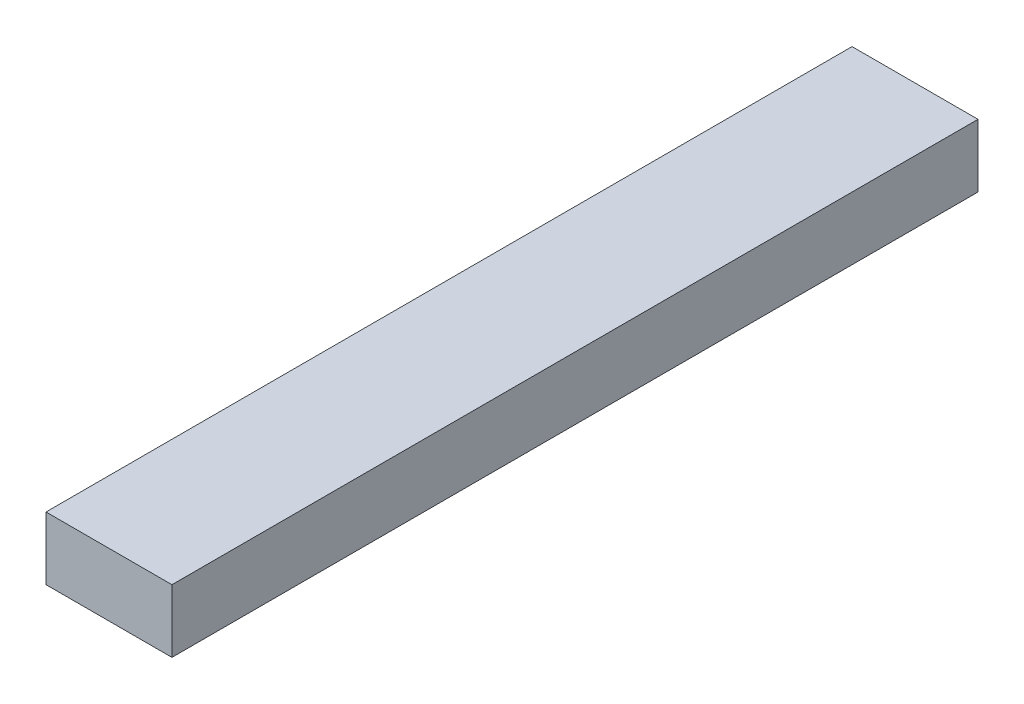
ISO-10303-21;
HEADER;
FILE_DESCRIPTION(('STEP AP214'),'2;1');
FILE_NAME('part.step','',(''),(''),'','','');
FILE_SCHEMA(('AUTOMOTIVE_DESIGN { 1 0 10303 214 1 1 1 1 }'));
ENDSEC;
DATA;
#1=APPLICATION_CONTEXT('core data for automotive mechanical design processes');
#2=APPLICATION_PROTOCOL_DEFINITION('international standard','automotive_design',2000,#1);
#3=PRODUCT_CONTEXT('',#1,'mechanical');
#4=PRODUCT('Part','Part','',(#3));
#5=PRODUCT_RELATED_PRODUCT_CATEGORY('part','',(#4));
#6=PRODUCT_DEFINITION_FORMATION('','',#4);
#7=PRODUCT_DEFINITION_CONTEXT('part definition',#1,'design');
#8=PRODUCT_DEFINITION('design','',#6,#7);
#9=PRODUCT_DEFINITION_SHAPE('','',#8);
#10=(LENGTH_UNIT() NAMED_UNIT(*) SI_UNIT(.MILLI.,.METRE.));
#11=(NAMED_UNIT(*) PLANE_ANGLE_UNIT() SI_UNIT($,.RADIAN.));
#12=(NAMED_UNIT(*) SI_UNIT($,.STERADIAN.) SOLID_ANGLE_UNIT());
#13=UNCERTAINTY_MEASURE_WITH_UNIT(LENGTH_MEASURE(1.E-05),#10,'distance_accuracy_value','');
#14=(GEOMETRIC_REPRESENTATION_CONTEXT(3) GLOBAL_UNCERTAINTY_ASSIGNED_CONTEXT((#13)) GLOBAL_UNIT_ASSIGNED_CONTEXT((#10,
#11,#12)) REPRESENTATION_CONTEXT('',''));
#15=CARTESIAN_POINT('',(0.,0.,0.));
#16=DIRECTION('',(0.,0.,1.));
#17=DIRECTION('',(1.,0.,0.));
#18=AXIS2_PLACEMENT_3D('',#15,#16,#17);
#19=CARTESIAN_POINT('',(50.,-25.,640.));
#20=DIRECTION('',(-1.,0.,0.));
#21=DIRECTION('',(0.,0.,1.));
#22=AXIS2_PLACEMENT_3D('',#19,#20,#21);
#23=PLANE('',#22);
#24=DIRECTION('',(0.,1.,0.));
#25=VECTOR('',#24,1.);
#26=CARTESIAN_POINT('',(50.,-25.,0.));
#27=LINE('',#26,#25);
#28=CARTESIAN_POINT('',(50.,-25.,0.));
#29=VERTEX_POINT('',#28);
#30=CARTESIAN_POINT('',(50.,25.,0.));
#31=VERTEX_POINT('',#30);
#32=EDGE_CURVE('E107',#29,#31,#27,.T.);
#33=ORIENTED_EDGE('',*,*,#32,.T.);
#34=DIRECTION('',(0.,0.,-1.));
#35=VECTOR('',#34,1.);
#36=CARTESIAN_POINT('',(50.,25.,640.));
#37=LINE('',#36,#35);
#38=CARTESIAN_POINT('',(50.,25.,640.));
#39=VERTEX_POINT('',#38);
#40=EDGE_CURVE('E11',#39,#31,#37,.T.);
#41=ORIENTED_EDGE('',*,*,#40,.F.);
#42=DIRECTION('',(0.,1.,0.));
#43=VECTOR('',#42,1.);
#44=CARTESIAN_POINT('',(50.,-25.,640.));
#45=LINE('',#44,#43);
#46=CARTESIAN_POINT('',(50.,-25.,640.));
#47=VERTEX_POINT('',#46);
#48=EDGE_CURVE('E91',#47,#39,#45,.T.);
#49=ORIENTED_EDGE('',*,*,#48,.F.);
#50=DIRECTION('',(0.,0.,-1.));
#51=VECTOR('',#50,1.);
#52=CARTESIAN_POINT('',(50.,-25.,640.));
#53=LINE('',#52,#51);
#54=EDGE_CURVE('E103',#47,#29,#53,.T.);
#55=ORIENTED_EDGE('',*,*,#54,.T.);
#56=EDGE_LOOP('',(#33,#41,#49,#55));
#57=FACE_BOUND('',#56,.T.);
#58=ADVANCED_FACE('F39',(#57),#23,.F.);
#59=CARTESIAN_POINT('',(-50.,25.,640.));
#60=DIRECTION('',(0.,-1.,0.));
#61=DIRECTION('',(0.,0.,-1.));
#62=AXIS2_PLACEMENT_3D('',#59,#60,#61);
#63=PLANE('',#62);
#64=DIRECTION('',(-1.,0.,0.));
#65=VECTOR('',#64,1.);
#66=CARTESIAN_POINT('',(-50.,25.,0.));
#67=LINE('',#66,#65);
#68=CARTESIAN_POINT('',(-50.,25.,0.));
#69=VERTEX_POINT('',#68);
#70=EDGE_CURVE('E96',#31,#69,#67,.T.);
#71=ORIENTED_EDGE('',*,*,#70,.T.);
#72=DIRECTION('',(0.,0.,-1.));
#73=VECTOR('',#72,1.);
#74=CARTESIAN_POINT('',(-50.,25.,640.));
#75=LINE('',#74,#73);
#76=CARTESIAN_POINT('',(-50.,25.,640.));
#77=VERTEX_POINT('',#76);
#78=EDGE_CURVE('E48',#77,#69,#75,.T.);
#79=ORIENTED_EDGE('',*,*,#78,.F.);
#80=DIRECTION('',(-1.,0.,0.));
#81=VECTOR('',#80,1.);
#82=CARTESIAN_POINT('',(-50.,25.,640.));
#83=LINE('',#82,#81);
#84=EDGE_CURVE('E86',#39,#77,#83,.T.);
#85=ORIENTED_EDGE('',*,*,#84,.F.);
#86=ORIENTED_EDGE('',*,*,#40,.T.);
#87=EDGE_LOOP('',(#71,#79,#85,#86));
#88=FACE_BOUND('',#87,.T.);
#89=ADVANCED_FACE('F95',(#88),#63,.F.);
#90=CARTESIAN_POINT('',(-50.,-25.,640.));
#91=DIRECTION('',(1.,0.,0.));
#92=DIRECTION('',(0.,0.,-1.));
#93=AXIS2_PLACEMENT_3D('',#90,#91,#92);
#94=PLANE('',#93);
#95=DIRECTION('',(0.,-1.,0.));
#96=VECTOR('',#95,1.);
#97=CARTESIAN_POINT('',(-50.,-25.,0.));
#98=LINE('',#97,#96);
#99=CARTESIAN_POINT('',(-50.,-25.,0.));
#100=VERTEX_POINT('',#99);
#101=EDGE_CURVE('E73',#69,#100,#98,.T.);
#102=ORIENTED_EDGE('',*,*,#101,.T.);
#103=DIRECTION('',(0.,0.,-1.));
#104=VECTOR('',#103,1.);
#105=CARTESIAN_POINT('',(-50.,-25.,640.));
#106=LINE('',#105,#104);
#107=CARTESIAN_POINT('',(-50.,-25.,640.));
#108=VERTEX_POINT('',#107);
#109=EDGE_CURVE('E98',#108,#100,#106,.T.);
#110=ORIENTED_EDGE('',*,*,#109,.F.);
#111=DIRECTION('',(0.,-1.,0.));
#112=VECTOR('',#111,1.);
#113=CARTESIAN_POINT('',(-50.,-25.,640.));
#114=LINE('',#113,#112);
#115=EDGE_CURVE('E89',#77,#108,#114,.T.);
#116=ORIENTED_EDGE('',*,*,#115,.F.);
#117=ORIENTED_EDGE('',*,*,#78,.T.);
#118=EDGE_LOOP('',(#102,#110,#116,#117));
#119=FACE_BOUND('',#118,.T.);
#120=ADVANCED_FACE('F99',(#119),#94,.F.);
#121=CARTESIAN_POINT('',(-50.,-25.,640.));
#122=DIRECTION('',(0.,1.,0.));
#123=DIRECTION('',(0.,0.,1.));
#124=AXIS2_PLACEMENT_3D('',#121,#122,#123);
#125=PLANE('',#124);
#126=DIRECTION('',(1.,0.,0.));
#127=VECTOR('',#126,1.);
#128=CARTESIAN_POINT('',(-50.,-25.,0.));
#129=LINE('',#128,#127);
#130=EDGE_CURVE('E79',#100,#29,#129,.T.);
#131=ORIENTED_EDGE('',*,*,#130,.T.);
#132=ORIENTED_EDGE('',*,*,#54,.F.);
#133=DIRECTION('',(1.,0.,0.));
#134=VECTOR('',#133,1.);
#135=CARTESIAN_POINT('',(-50.,-25.,640.));
#136=LINE('',#135,#134);
#137=EDGE_CURVE('E56',#108,#47,#136,.T.);
#138=ORIENTED_EDGE('',*,*,#137,.F.);
#139=ORIENTED_EDGE('',*,*,#109,.T.);
#140=EDGE_LOOP('',(#131,#132,#138,#139));
#141=FACE_BOUND('',#140,.T.);
#142=ADVANCED_FACE('F120',(#141),#125,.F.);
#143=CARTESIAN_POINT('',(0.,0.,640.));
#144=DIRECTION('',(0.,0.,-1.));
#145=DIRECTION('',(-1.,0.,0.));
#146=AXIS2_PLACEMENT_3D('',#143,#144,#145);
#147=PLANE('',#146);
#148=ORIENTED_EDGE('',*,*,#48,.T.);
#149=ORIENTED_EDGE('',*,*,#84,.T.);
#150=ORIENTED_EDGE('',*,*,#115,.T.);
#151=ORIENTED_EDGE('',*,*,#137,.T.);
#152=EDGE_LOOP('',(#148,#149,#150,#151));
#153=FACE_BOUND('',#152,.T.);
#154=ADVANCED_FACE('F87',(#153),#147,.F.);
#155=CARTESIAN_POINT('',(0.,0.,0.));
#156=DIRECTION('',(0.,0.,-1.));
#157=DIRECTION('',(-1.,0.,0.));
#158=AXIS2_PLACEMENT_3D('',#155,#156,#157);
#159=PLANE('',#158);
#160=ORIENTED_EDGE('',*,*,#32,.F.);
#161=ORIENTED_EDGE('',*,*,#130,.F.);
#162=ORIENTED_EDGE('',*,*,#101,.F.);
#163=ORIENTED_EDGE('',*,*,#70,.F.);
#164=EDGE_LOOP('',(#160,#161,#162,#163));
#165=FACE_BOUND('',#164,.T.);
#166=ADVANCED_FACE('F123',(#165),#159,.T.);
#167=CLOSED_SHELL('',(#58,#89,#120,#142,#154,#166));
#168=MANIFOLD_SOLID_BREP('B2',#167);
#169=ADVANCED_BREP_SHAPE_REPRESENTATION('',(#18,#168),#14);
#170=SHAPE_DEFINITION_REPRESENTATION(#9,#169);
ENDSEC;
END-ISO-10303-21;
